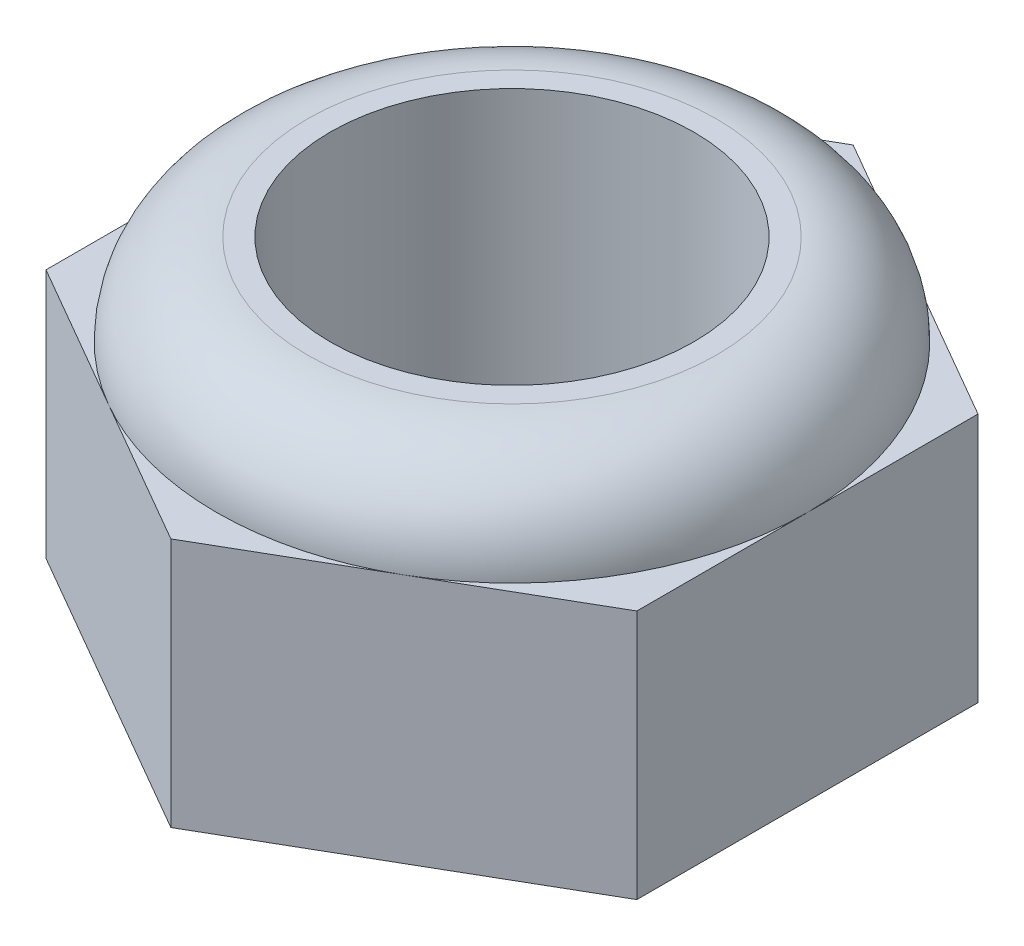
ISO-10303-21;
HEADER;
FILE_DESCRIPTION(('STEP AP214'),'2;1');
FILE_NAME('part.step','',(''),(''),'','','');
FILE_SCHEMA(('AUTOMOTIVE_DESIGN { 1 0 10303 214 1 1 1 1 }'));
ENDSEC;
DATA;
#1=APPLICATION_CONTEXT('core data for automotive mechanical design processes');
#2=APPLICATION_PROTOCOL_DEFINITION('international standard','automotive_design',2000,#1);
#3=PRODUCT_CONTEXT('',#1,'mechanical');
#4=PRODUCT('Part','Part','',(#3));
#5=PRODUCT_RELATED_PRODUCT_CATEGORY('part','',(#4));
#6=PRODUCT_DEFINITION_FORMATION('','',#4);
#7=PRODUCT_DEFINITION_CONTEXT('part definition',#1,'design');
#8=PRODUCT_DEFINITION('design','',#6,#7);
#9=PRODUCT_DEFINITION_SHAPE('','',#8);
#10=(LENGTH_UNIT() NAMED_UNIT(*) SI_UNIT(.MILLI.,.METRE.));
#11=(NAMED_UNIT(*) PLANE_ANGLE_UNIT() SI_UNIT($,.RADIAN.));
#12=(NAMED_UNIT(*) SI_UNIT($,.STERADIAN.) SOLID_ANGLE_UNIT());
#13=UNCERTAINTY_MEASURE_WITH_UNIT(LENGTH_MEASURE(1.E-05),#10,'distance_accuracy_value','');
#14=(GEOMETRIC_REPRESENTATION_CONTEXT(3) GLOBAL_UNCERTAINTY_ASSIGNED_CONTEXT((#13)) GLOBAL_UNIT_ASSIGNED_CONTEXT((#10,
#11,#12)) REPRESENTATION_CONTEXT('',''));
#15=CARTESIAN_POINT('',(0.,0.,0.));
#16=DIRECTION('',(0.,0.,1.));
#17=DIRECTION('',(1.,0.,0.));
#18=AXIS2_PLACEMENT_3D('',#15,#16,#17);
#19=CARTESIAN_POINT('',(0.,5.5,0.));
#20=DIRECTION('',(0.,1.,0.));
#21=DIRECTION('',(0.,0.,1.));
#22=AXIS2_PLACEMENT_3D('',#19,#20,#21);
#23=PLANE('',#22);
#24=CARTESIAN_POINT('',(0.,5.5,0.));
#25=DIRECTION('',(0.,1.,0.));
#26=DIRECTION('',(0.,0.,1.));
#27=AXIS2_PLACEMENT_3D('',#24,#25,#26);
#28=CIRCLE('',#27,6.5);
#29=CARTESIAN_POINT('',(3.25,5.5,5.62916512459885));
#30=VERTEX_POINT('',#29);
#31=CARTESIAN_POINT('',(6.5,5.5,0.));
#32=VERTEX_POINT('',#31);
#33=EDGE_CURVE('E125',#30,#32,#28,.T.);
#34=ORIENTED_EDGE('',*,*,#33,.F.);
#35=DIRECTION('',(0.866025403784438,0.,-0.5));
#36=VECTOR('',#35,1.);
#37=CARTESIAN_POINT('',(0.,5.5,7.50555349946514));
#38=LINE('',#37,#36);
#39=CARTESIAN_POINT('',(6.5,5.5,3.75277674973257));
#40=VERTEX_POINT('',#39);
#41=EDGE_CURVE('E112',#30,#40,#38,.T.);
#42=ORIENTED_EDGE('',*,*,#41,.T.);
#43=DIRECTION('',(0.,0.,-1.));
#44=VECTOR('',#43,1.);
#45=CARTESIAN_POINT('',(6.5,5.5,3.75277674973257));
#46=LINE('',#45,#44);
#47=EDGE_CURVE('E126',#40,#32,#46,.T.);
#48=ORIENTED_EDGE('',*,*,#47,.T.);
#49=EDGE_LOOP('',(#34,#42,#48));
#50=FACE_BOUND('',#49,.T.);
#51=ADVANCED_FACE('F34',(#50),#23,.T.);
#52=CARTESIAN_POINT('',(3.25,5.5,-5.62916512459885));
#53=VERTEX_POINT('',#52);
#54=EDGE_CURVE('E42',#32,#53,#28,.T.);
#55=ORIENTED_EDGE('',*,*,#54,.F.);
#56=CARTESIAN_POINT('',(6.5,5.5,-3.75277674973257));
#57=VERTEX_POINT('',#56);
#58=EDGE_CURVE('E111',#32,#57,#46,.T.);
#59=ORIENTED_EDGE('',*,*,#58,.T.);
#60=DIRECTION('',(-0.866025403784439,0.,-0.5));
#61=VECTOR('',#60,1.);
#62=CARTESIAN_POINT('',(6.5,5.5,-3.75277674973257));
#63=LINE('',#62,#61);
#64=EDGE_CURVE('E141',#57,#53,#63,.T.);
#65=ORIENTED_EDGE('',*,*,#64,.T.);
#66=EDGE_LOOP('',(#55,#59,#65));
#67=FACE_BOUND('',#66,.T.);
#68=ADVANCED_FACE('F209',(#67),#23,.T.);
#69=CARTESIAN_POINT('',(-3.25,5.5,-5.62916512459885));
#70=VERTEX_POINT('',#69);
#71=EDGE_CURVE('E207',#53,#70,#28,.T.);
#72=ORIENTED_EDGE('',*,*,#71,.F.);
#73=CARTESIAN_POINT('',(0.,5.5,-7.50555349946514));
#74=VERTEX_POINT('',#73);
#75=EDGE_CURVE('E140',#53,#74,#63,.T.);
#76=ORIENTED_EDGE('',*,*,#75,.T.);
#77=DIRECTION('',(-0.866025403784439,0.,0.5));
#78=VECTOR('',#77,1.);
#79=CARTESIAN_POINT('',(0.,5.5,-7.50555349946514));
#80=LINE('',#79,#78);
#81=EDGE_CURVE('E145',#74,#70,#80,.T.);
#82=ORIENTED_EDGE('',*,*,#81,.T.);
#83=EDGE_LOOP('',(#72,#76,#82));
#84=FACE_BOUND('',#83,.T.);
#85=ADVANCED_FACE('F206',(#84),#23,.T.);
#86=CARTESIAN_POINT('',(-6.5,5.5,0.));
#87=VERTEX_POINT('',#86);
#88=EDGE_CURVE('E57',#70,#87,#28,.T.);
#89=ORIENTED_EDGE('',*,*,#88,.F.);
#90=CARTESIAN_POINT('',(-6.5,5.5,-3.75277674973257));
#91=VERTEX_POINT('',#90);
#92=EDGE_CURVE('E144',#70,#91,#80,.T.);
#93=ORIENTED_EDGE('',*,*,#92,.T.);
#94=DIRECTION('',(0.,0.,1.));
#95=VECTOR('',#94,1.);
#96=CARTESIAN_POINT('',(-6.5,5.5,-3.75277674973257));
#97=LINE('',#96,#95);
#98=EDGE_CURVE('E149',#91,#87,#97,.T.);
#99=ORIENTED_EDGE('',*,*,#98,.T.);
#100=EDGE_LOOP('',(#89,#93,#99));
#101=FACE_BOUND('',#100,.T.);
#102=ADVANCED_FACE('F204',(#101),#23,.T.);
#103=CARTESIAN_POINT('',(-3.25,5.5,5.62916512459885));
#104=VERTEX_POINT('',#103);
#105=EDGE_CURVE('E132',#87,#104,#28,.T.);
#106=ORIENTED_EDGE('',*,*,#105,.F.);
#107=CARTESIAN_POINT('',(-6.5,5.5,3.75277674973257));
#108=VERTEX_POINT('',#107);
#109=EDGE_CURVE('E148',#87,#108,#97,.T.);
#110=ORIENTED_EDGE('',*,*,#109,.T.);
#111=DIRECTION('',(0.866025403784439,0.,0.5));
#112=VECTOR('',#111,1.);
#113=CARTESIAN_POINT('',(-6.5,5.5,3.75277674973257));
#114=LINE('',#113,#112);
#115=EDGE_CURVE('E152',#108,#104,#114,.T.);
#116=ORIENTED_EDGE('',*,*,#115,.T.);
#117=EDGE_LOOP('',(#106,#110,#116));
#118=FACE_BOUND('',#117,.T.);
#119=ADVANCED_FACE('F215',(#118),#23,.T.);
#120=EDGE_CURVE('E49',#104,#30,#28,.T.);
#121=ORIENTED_EDGE('',*,*,#120,.F.);
#122=CARTESIAN_POINT('',(0.,5.5,7.50555349946514));
#123=VERTEX_POINT('',#122);
#124=EDGE_CURVE('E107',#104,#123,#114,.T.);
#125=ORIENTED_EDGE('',*,*,#124,.T.);
#126=EDGE_CURVE('E104',#123,#30,#38,.T.);
#127=ORIENTED_EDGE('',*,*,#126,.T.);
#128=EDGE_LOOP('',(#121,#125,#127));
#129=FACE_BOUND('',#128,.T.);
#130=ADVANCED_FACE('F106',(#129),#23,.T.);
#131=CARTESIAN_POINT('',(0.,0.,0.));
#132=DIRECTION('',(0.,1.,0.));
#133=DIRECTION('',(0.,0.,1.));
#134=AXIS2_PLACEMENT_3D('',#131,#132,#133);
#135=PLANE('',#134);
#136=DIRECTION('',(0.866025403784438,0.,-0.5));
#137=VECTOR('',#136,1.);
#138=CARTESIAN_POINT('',(0.,0.,7.50555349946514));
#139=LINE('',#138,#137);
#140=CARTESIAN_POINT('',(0.,0.,7.50555349946514));
#141=VERTEX_POINT('',#140);
#142=CARTESIAN_POINT('',(6.5,0.,3.75277674973257));
#143=VERTEX_POINT('',#142);
#144=EDGE_CURVE('E137',#141,#143,#139,.T.);
#145=ORIENTED_EDGE('',*,*,#144,.F.);
#146=DIRECTION('',(0.866025403784439,0.,0.5));
#147=VECTOR('',#146,1.);
#148=CARTESIAN_POINT('',(-6.5,0.,3.75277674973257));
#149=LINE('',#148,#147);
#150=CARTESIAN_POINT('',(-6.5,0.,3.75277674973257));
#151=VERTEX_POINT('',#150);
#152=EDGE_CURVE('E123',#151,#141,#149,.T.);
#153=ORIENTED_EDGE('',*,*,#152,.F.);
#154=DIRECTION('',(0.,0.,1.));
#155=VECTOR('',#154,1.);
#156=CARTESIAN_POINT('',(-6.5,0.,-3.75277674973257));
#157=LINE('',#156,#155);
#158=CARTESIAN_POINT('',(-6.5,0.,-3.75277674973257));
#159=VERTEX_POINT('',#158);
#160=EDGE_CURVE('E163',#159,#151,#157,.T.);
#161=ORIENTED_EDGE('',*,*,#160,.F.);
#162=DIRECTION('',(-0.866025403784439,0.,0.5));
#163=VECTOR('',#162,1.);
#164=CARTESIAN_POINT('',(0.,0.,-7.50555349946514));
#165=LINE('',#164,#163);
#166=CARTESIAN_POINT('',(0.,0.,-7.50555349946514));
#167=VERTEX_POINT('',#166);
#168=EDGE_CURVE('E161',#167,#159,#165,.T.);
#169=ORIENTED_EDGE('',*,*,#168,.F.);
#170=DIRECTION('',(-0.866025403784439,0.,-0.5));
#171=VECTOR('',#170,1.);
#172=CARTESIAN_POINT('',(6.5,0.,-3.75277674973257));
#173=LINE('',#172,#171);
#174=CARTESIAN_POINT('',(6.5,0.,-3.75277674973257));
#175=VERTEX_POINT('',#174);
#176=EDGE_CURVE('E159',#175,#167,#173,.T.);
#177=ORIENTED_EDGE('',*,*,#176,.F.);
#178=DIRECTION('',(0.,0.,-1.));
#179=VECTOR('',#178,1.);
#180=CARTESIAN_POINT('',(6.5,0.,3.75277674973257));
#181=LINE('',#180,#179);
#182=EDGE_CURVE('E157',#143,#175,#181,.T.);
#183=ORIENTED_EDGE('',*,*,#182,.F.);
#184=EDGE_LOOP('',(#145,#153,#161,#169,#177,#183));
#185=FACE_BOUND('',#184,.T.);
#186=CARTESIAN_POINT('',(0.,0.,0.));
#187=DIRECTION('',(0.,1.,0.));
#188=DIRECTION('',(0.,0.,1.));
#189=AXIS2_PLACEMENT_3D('',#186,#187,#188);
#190=CIRCLE('',#189,4.);
#191=CARTESIAN_POINT('',(0.,0.,4.));
#192=VERTEX_POINT('',#191);
#193=EDGE_CURVE('E128',#192,#192,#190,.T.);
#194=ORIENTED_EDGE('',*,*,#193,.T.);
#195=EDGE_LOOP('',(#194));
#196=FACE_BOUND('',#195,.T.);
#197=ADVANCED_FACE('F189',(#185,#196),#135,.F.);
#198=CARTESIAN_POINT('',(0.,5.5,7.50555349946514));
#199=DIRECTION('',(-0.5,0.,-0.866025403784439));
#200=DIRECTION('',(-0.866025403784439,0.,0.5));
#201=AXIS2_PLACEMENT_3D('',#198,#199,#200);
#202=PLANE('',#201);
#203=ORIENTED_EDGE('',*,*,#144,.T.);
#204=DIRECTION('',(0.,-1.,0.));
#205=VECTOR('',#204,1.);
#206=CARTESIAN_POINT('',(6.5,5.5,3.75277674973257));
#207=LINE('',#206,#205);
#208=EDGE_CURVE('E119',#40,#143,#207,.T.);
#209=ORIENTED_EDGE('',*,*,#208,.F.);
#210=ORIENTED_EDGE('',*,*,#41,.F.);
#211=ORIENTED_EDGE('',*,*,#126,.F.);
#212=DIRECTION('',(0.,-1.,0.));
#213=VECTOR('',#212,1.);
#214=CARTESIAN_POINT('',(0.,5.5,7.50555349946514));
#215=LINE('',#214,#213);
#216=EDGE_CURVE('E155',#123,#141,#215,.T.);
#217=ORIENTED_EDGE('',*,*,#216,.T.);
#218=EDGE_LOOP('',(#203,#209,#210,#211,#217));
#219=FACE_BOUND('',#218,.T.);
#220=ADVANCED_FACE('F117',(#219),#202,.F.);
#221=CARTESIAN_POINT('',(6.5,5.5,3.75277674973257));
#222=DIRECTION('',(-1.,0.,0.));
#223=DIRECTION('',(0.,0.,1.));
#224=AXIS2_PLACEMENT_3D('',#221,#222,#223);
#225=PLANE('',#224);
#226=ORIENTED_EDGE('',*,*,#182,.T.);
#227=DIRECTION('',(0.,-1.,0.));
#228=VECTOR('',#227,1.);
#229=CARTESIAN_POINT('',(6.5,5.5,-3.75277674973257));
#230=LINE('',#229,#228);
#231=EDGE_CURVE('E133',#57,#175,#230,.T.);
#232=ORIENTED_EDGE('',*,*,#231,.F.);
#233=ORIENTED_EDGE('',*,*,#58,.F.);
#234=ORIENTED_EDGE('',*,*,#47,.F.);
#235=ORIENTED_EDGE('',*,*,#208,.T.);
#236=EDGE_LOOP('',(#226,#232,#233,#234,#235));
#237=FACE_BOUND('',#236,.T.);
#238=ADVANCED_FACE('F210',(#237),#225,.F.);
#239=CARTESIAN_POINT('',(6.5,5.5,-3.75277674973257));
#240=DIRECTION('',(-0.5,0.,0.866025403784439));
#241=DIRECTION('',(0.866025403784439,0.,0.5));
#242=AXIS2_PLACEMENT_3D('',#239,#240,#241);
#243=PLANE('',#242);
#244=ORIENTED_EDGE('',*,*,#176,.T.);
#245=DIRECTION('',(0.,-1.,0.));
#246=VECTOR('',#245,1.);
#247=CARTESIAN_POINT('',(0.,5.5,-7.50555349946514));
#248=LINE('',#247,#246);
#249=EDGE_CURVE('E173',#74,#167,#248,.T.);
#250=ORIENTED_EDGE('',*,*,#249,.F.);
#251=ORIENTED_EDGE('',*,*,#75,.F.);
#252=ORIENTED_EDGE('',*,*,#64,.F.);
#253=ORIENTED_EDGE('',*,*,#231,.T.);
#254=EDGE_LOOP('',(#244,#250,#251,#252,#253));
#255=FACE_BOUND('',#254,.T.);
#256=ADVANCED_FACE('F181',(#255),#243,.F.);
#257=CARTESIAN_POINT('',(0.,5.5,-7.50555349946514));
#258=DIRECTION('',(0.5,0.,0.866025403784439));
#259=DIRECTION('',(0.866025403784439,0.,-0.5));
#260=AXIS2_PLACEMENT_3D('',#257,#258,#259);
#261=PLANE('',#260);
#262=ORIENTED_EDGE('',*,*,#168,.T.);
#263=DIRECTION('',(0.,-1.,0.));
#264=VECTOR('',#263,1.);
#265=CARTESIAN_POINT('',(-6.5,5.5,-3.75277674973257));
#266=LINE('',#265,#264);
#267=EDGE_CURVE('E170',#91,#159,#266,.T.);
#268=ORIENTED_EDGE('',*,*,#267,.F.);
#269=ORIENTED_EDGE('',*,*,#92,.F.);
#270=ORIENTED_EDGE('',*,*,#81,.F.);
#271=ORIENTED_EDGE('',*,*,#249,.T.);
#272=EDGE_LOOP('',(#262,#268,#269,#270,#271));
#273=FACE_BOUND('',#272,.T.);
#274=ADVANCED_FACE('F195',(#273),#261,.F.);
#275=CARTESIAN_POINT('',(-6.5,5.5,-3.75277674973257));
#276=DIRECTION('',(1.,0.,0.));
#277=DIRECTION('',(0.,0.,-1.));
#278=AXIS2_PLACEMENT_3D('',#275,#276,#277);
#279=PLANE('',#278);
#280=ORIENTED_EDGE('',*,*,#160,.T.);
#281=DIRECTION('',(0.,-1.,0.));
#282=VECTOR('',#281,1.);
#283=CARTESIAN_POINT('',(-6.5,5.5,3.75277674973257));
#284=LINE('',#283,#282);
#285=EDGE_CURVE('E167',#108,#151,#284,.T.);
#286=ORIENTED_EDGE('',*,*,#285,.F.);
#287=ORIENTED_EDGE('',*,*,#109,.F.);
#288=ORIENTED_EDGE('',*,*,#98,.F.);
#289=ORIENTED_EDGE('',*,*,#267,.T.);
#290=EDGE_LOOP('',(#280,#286,#287,#288,#289));
#291=FACE_BOUND('',#290,.T.);
#292=ADVANCED_FACE('F200',(#291),#279,.F.);
#293=CARTESIAN_POINT('',(-6.5,5.5,3.75277674973257));
#294=DIRECTION('',(0.5,0.,-0.866025403784439));
#295=DIRECTION('',(-0.866025403784439,0.,-0.5));
#296=AXIS2_PLACEMENT_3D('',#293,#294,#295);
#297=PLANE('',#296);
#298=ORIENTED_EDGE('',*,*,#152,.T.);
#299=ORIENTED_EDGE('',*,*,#216,.F.);
#300=ORIENTED_EDGE('',*,*,#124,.F.);
#301=ORIENTED_EDGE('',*,*,#115,.F.);
#302=ORIENTED_EDGE('',*,*,#285,.T.);
#303=EDGE_LOOP('',(#298,#299,#300,#301,#302));
#304=FACE_BOUND('',#303,.T.);
#305=ADVANCED_FACE('F212',(#304),#297,.F.);
#306=CARTESIAN_POINT('',(0.,5.5,0.));
#307=DIRECTION('',(0.,-1.,0.));
#308=DIRECTION('',(0.,0.,-1.));
#309=AXIS2_PLACEMENT_3D('',#306,#307,#308);
#310=CYLINDRICAL_SURFACE('',#309,4.);
#311=ORIENTED_EDGE('',*,*,#193,.F.);
#312=EDGE_LOOP('',(#311));
#313=FACE_BOUND('',#312,.T.);
#314=CARTESIAN_POINT('',(0.,7.5,0.));
#315=DIRECTION('',(0.,1.,0.));
#316=DIRECTION('',(0.,0.,1.));
#317=AXIS2_PLACEMENT_3D('',#314,#315,#316);
#318=CIRCLE('',#317,4.);
#319=CARTESIAN_POINT('',(0.,7.5,4.));
#320=VERTEX_POINT('',#319);
#321=EDGE_CURVE('E129',#320,#320,#318,.T.);
#322=ORIENTED_EDGE('',*,*,#321,.T.);
#323=EDGE_LOOP('',(#322));
#324=FACE_BOUND('',#323,.T.);
#325=ADVANCED_FACE('F298',(#313,#324),#310,.F.);
#326=CARTESIAN_POINT('',(0.,7.5,0.));
#327=DIRECTION('',(0.,1.,0.));
#328=DIRECTION('',(0.,0.,1.));
#329=AXIS2_PLACEMENT_3D('',#326,#327,#328);
#330=PLANE('',#329);
#331=CARTESIAN_POINT('',(0.,7.5,0.));
#332=DIRECTION('',(0.,1.,0.));
#333=DIRECTION('',(0.,0.,1.));
#334=AXIS2_PLACEMENT_3D('',#331,#332,#333);
#335=CIRCLE('',#334,4.5);
#336=CARTESIAN_POINT('',(0.,7.5,4.5));
#337=VERTEX_POINT('',#336);
#338=EDGE_CURVE('E11',#337,#337,#335,.T.);
#339=ORIENTED_EDGE('',*,*,#338,.T.);
#340=EDGE_LOOP('',(#339));
#341=FACE_BOUND('',#340,.T.);
#342=ORIENTED_EDGE('',*,*,#321,.F.);
#343=EDGE_LOOP('',(#342));
#344=FACE_BOUND('',#343,.T.);
#345=ADVANCED_FACE('F304',(#341,#344),#330,.T.);
#346=CARTESIAN_POINT('',(0.,5.5,0.));
#347=DIRECTION('',(0.,1.,0.));
#348=DIRECTION('',(0.,0.,1.));
#349=AXIS2_PLACEMENT_3D('',#346,#347,#348);
#350=TOROIDAL_SURFACE('',#349,4.5,2.);
#351=ORIENTED_EDGE('',*,*,#88,.T.);
#352=ORIENTED_EDGE('',*,*,#105,.T.);
#353=ORIENTED_EDGE('',*,*,#120,.T.);
#354=ORIENTED_EDGE('',*,*,#33,.T.);
#355=ORIENTED_EDGE('',*,*,#54,.T.);
#356=ORIENTED_EDGE('',*,*,#71,.T.);
#357=EDGE_LOOP('',(#351,#352,#353,#354,#355,#356));
#358=FACE_BOUND('',#357,.T.);
#359=ORIENTED_EDGE('',*,*,#338,.F.);
#360=EDGE_LOOP('',(#359));
#361=FACE_BOUND('',#360,.T.);
#362=ADVANCED_FACE('F36',(#358,#361),#350,.T.);
#363=CLOSED_SHELL('',(#51,#68,#85,#102,#119,#130,#197,#220,#238,#256,#274,#292,#305,#325,#345,#362));
#364=MANIFOLD_SOLID_BREP('B2',#363);
#365=ADVANCED_BREP_SHAPE_REPRESENTATION('',(#18,#364),#14);
#366=SHAPE_DEFINITION_REPRESENTATION(#9,#365);
ENDSEC;
END-ISO-10303-21;
